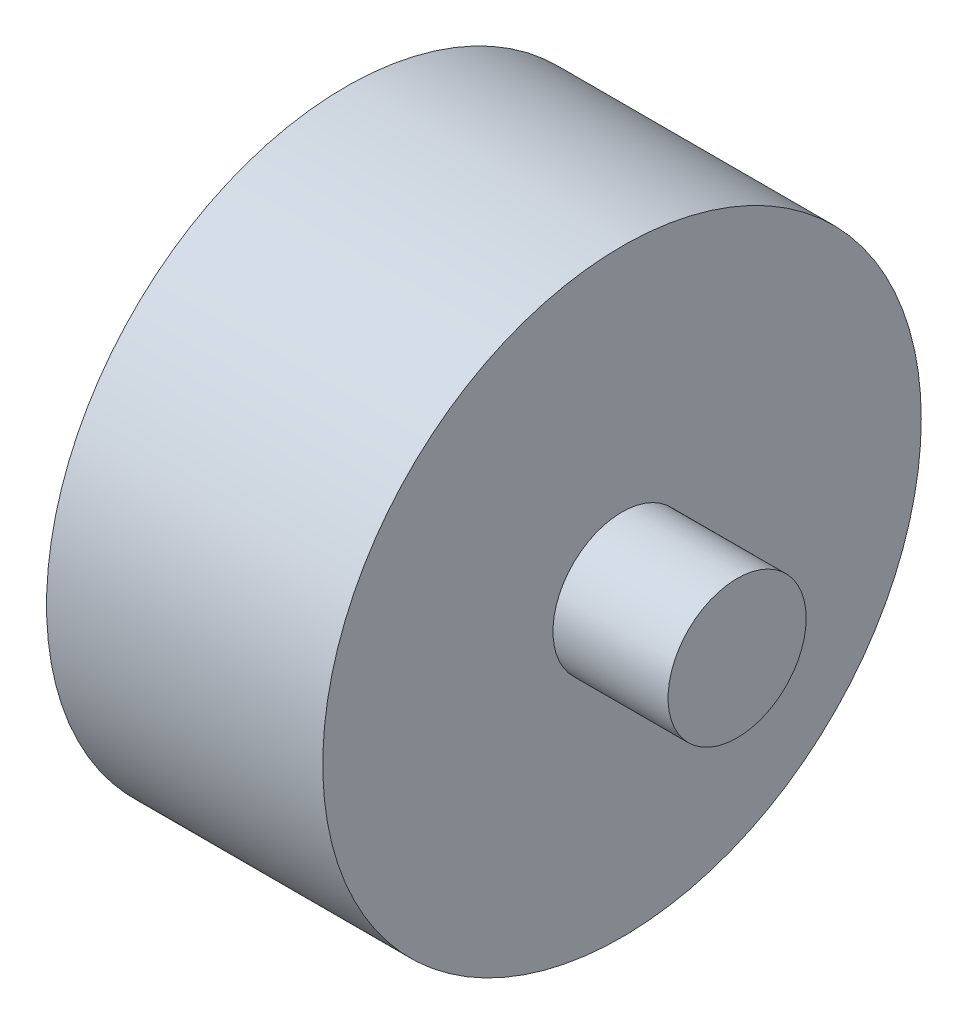
ISO-10303-21;
HEADER;
FILE_DESCRIPTION(('STEP AP214'),'2;1');
FILE_NAME('part.step','',(''),(''),'','','');
FILE_SCHEMA(('AUTOMOTIVE_DESIGN { 1 0 10303 214 1 1 1 1 }'));
ENDSEC;
DATA;
#1=APPLICATION_CONTEXT('core data for automotive mechanical design processes');
#2=APPLICATION_PROTOCOL_DEFINITION('international standard','automotive_design',2000,#1);
#3=PRODUCT_CONTEXT('',#1,'mechanical');
#4=PRODUCT('Part','Part','',(#3));
#5=PRODUCT_RELATED_PRODUCT_CATEGORY('part','',(#4));
#6=PRODUCT_DEFINITION_FORMATION('','',#4);
#7=PRODUCT_DEFINITION_CONTEXT('part definition',#1,'design');
#8=PRODUCT_DEFINITION('design','',#6,#7);
#9=PRODUCT_DEFINITION_SHAPE('','',#8);
#10=(LENGTH_UNIT() NAMED_UNIT(*) SI_UNIT(.MILLI.,.METRE.));
#11=(NAMED_UNIT(*) PLANE_ANGLE_UNIT() SI_UNIT($,.RADIAN.));
#12=(NAMED_UNIT(*) SI_UNIT($,.STERADIAN.) SOLID_ANGLE_UNIT());
#13=UNCERTAINTY_MEASURE_WITH_UNIT(LENGTH_MEASURE(1.E-05),#10,'distance_accuracy_value','');
#14=(GEOMETRIC_REPRESENTATION_CONTEXT(3) GLOBAL_UNCERTAINTY_ASSIGNED_CONTEXT((#13)) GLOBAL_UNIT_ASSIGNED_CONTEXT((#10,
#11,#12)) REPRESENTATION_CONTEXT('',''));
#15=CARTESIAN_POINT('',(0.,0.,0.));
#16=DIRECTION('',(0.,0.,1.));
#17=DIRECTION('',(1.,0.,0.));
#18=AXIS2_PLACEMENT_3D('',#15,#16,#17);
#19=CARTESIAN_POINT('',(60.,0.,0.));
#20=DIRECTION('',(-1.,0.,0.));
#21=DIRECTION('',(0.,0.,1.));
#22=AXIS2_PLACEMENT_3D('',#19,#20,#21);
#23=CYLINDRICAL_SURFACE('',#22,65.);
#24=CARTESIAN_POINT('',(60.,0.,0.));
#25=DIRECTION('',(1.,0.,0.));
#26=DIRECTION('',(0.,0.,-1.));
#27=AXIS2_PLACEMENT_3D('',#24,#25,#26);
#28=CIRCLE('',#27,65.);
#29=CARTESIAN_POINT('',(60.,0.,-65.));
#30=VERTEX_POINT('',#29);
#31=EDGE_CURVE('E38',#30,#30,#28,.T.);
#32=ORIENTED_EDGE('',*,*,#31,.F.);
#33=EDGE_LOOP('',(#32));
#34=FACE_BOUND('',#33,.T.);
#35=CARTESIAN_POINT('',(0.,0.,0.));
#36=DIRECTION('',(1.,0.,0.));
#37=DIRECTION('',(0.,0.,-1.));
#38=AXIS2_PLACEMENT_3D('',#35,#36,#37);
#39=CIRCLE('',#38,65.);
#40=CARTESIAN_POINT('',(0.,0.,-65.));
#41=VERTEX_POINT('',#40);
#42=EDGE_CURVE('E34',#41,#41,#39,.T.);
#43=ORIENTED_EDGE('',*,*,#42,.T.);
#44=EDGE_LOOP('',(#43));
#45=FACE_BOUND('',#44,.T.);
#46=ADVANCED_FACE('F31',(#34,#45),#23,.T.);
#47=CARTESIAN_POINT('',(60.,0.,0.));
#48=DIRECTION('',(1.,0.,0.));
#49=DIRECTION('',(0.,0.,-1.));
#50=AXIS2_PLACEMENT_3D('',#47,#48,#49);
#51=PLANE('',#50);
#52=CARTESIAN_POINT('',(60.,0.,0.));
#53=DIRECTION('',(1.,0.,0.));
#54=DIRECTION('',(0.,0.,-1.));
#55=AXIS2_PLACEMENT_3D('',#52,#53,#54);
#56=CIRCLE('',#55,15.);
#57=CARTESIAN_POINT('',(60.,0.,-15.));
#58=VERTEX_POINT('',#57);
#59=EDGE_CURVE('E10',#58,#58,#56,.T.);
#60=ORIENTED_EDGE('',*,*,#59,.F.);
#61=EDGE_LOOP('',(#60));
#62=FACE_BOUND('',#61,.T.);
#63=ORIENTED_EDGE('',*,*,#31,.T.);
#64=EDGE_LOOP('',(#63));
#65=FACE_BOUND('',#64,.T.);
#66=ADVANCED_FACE('F55',(#62,#65),#51,.T.);
#67=CARTESIAN_POINT('',(0.,0.,0.));
#68=DIRECTION('',(1.,0.,0.));
#69=DIRECTION('',(0.,0.,-1.));
#70=AXIS2_PLACEMENT_3D('',#67,#68,#69);
#71=PLANE('',#70);
#72=ORIENTED_EDGE('',*,*,#42,.F.);
#73=EDGE_LOOP('',(#72));
#74=FACE_BOUND('',#73,.T.);
#75=ADVANCED_FACE('F52',(#74),#71,.F.);
#76=CARTESIAN_POINT('',(85.,0.,0.));
#77=DIRECTION('',(-1.,0.,0.));
#78=DIRECTION('',(0.,0.,1.));
#79=AXIS2_PLACEMENT_3D('',#76,#77,#78);
#80=CYLINDRICAL_SURFACE('',#79,15.);
#81=CARTESIAN_POINT('',(85.,0.,0.));
#82=DIRECTION('',(1.,0.,0.));
#83=DIRECTION('',(0.,0.,-1.));
#84=AXIS2_PLACEMENT_3D('',#81,#82,#83);
#85=CIRCLE('',#84,15.);
#86=CARTESIAN_POINT('',(85.,0.,-15.));
#87=VERTEX_POINT('',#86);
#88=EDGE_CURVE('E44',#87,#87,#85,.T.);
#89=ORIENTED_EDGE('',*,*,#88,.F.);
#90=EDGE_LOOP('',(#89));
#91=FACE_BOUND('',#90,.T.);
#92=ORIENTED_EDGE('',*,*,#59,.T.);
#93=EDGE_LOOP('',(#92));
#94=FACE_BOUND('',#93,.T.);
#95=ADVANCED_FACE('F54',(#91,#94),#80,.T.);
#96=CARTESIAN_POINT('',(85.,0.,0.));
#97=DIRECTION('',(1.,0.,0.));
#98=DIRECTION('',(0.,0.,-1.));
#99=AXIS2_PLACEMENT_3D('',#96,#97,#98);
#100=PLANE('',#99);
#101=ORIENTED_EDGE('',*,*,#88,.T.);
#102=EDGE_LOOP('',(#101));
#103=FACE_BOUND('',#102,.T.);
#104=ADVANCED_FACE('F60',(#103),#100,.T.);
#105=CLOSED_SHELL('',(#46,#66,#75,#95,#104));
#106=MANIFOLD_SOLID_BREP('B2',#105);
#107=ADVANCED_BREP_SHAPE_REPRESENTATION('',(#18,#106),#14);
#108=SHAPE_DEFINITION_REPRESENTATION(#9,#107);
ENDSEC;
END-ISO-10303-21;
